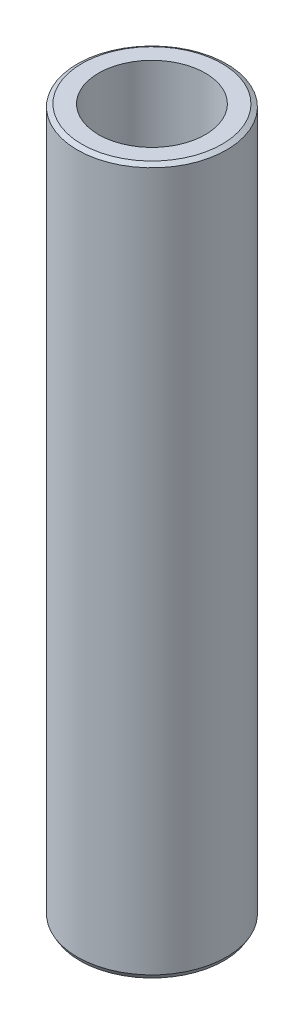
ISO-10303-21;
HEADER;
FILE_DESCRIPTION(('STEP AP214'),'2;1');
FILE_NAME('part.step','',(''),(''),'','','');
FILE_SCHEMA(('AUTOMOTIVE_DESIGN { 1 0 10303 214 1 1 1 1 }'));
ENDSEC;
DATA;
#1=APPLICATION_CONTEXT('core data for automotive mechanical design processes');
#2=APPLICATION_PROTOCOL_DEFINITION('international standard','automotive_design',2000,#1);
#3=PRODUCT_CONTEXT('',#1,'mechanical');
#4=PRODUCT('Part','Part','',(#3));
#5=PRODUCT_RELATED_PRODUCT_CATEGORY('part','',(#4));
#6=PRODUCT_DEFINITION_FORMATION('','',#4);
#7=PRODUCT_DEFINITION_CONTEXT('part definition',#1,'design');
#8=PRODUCT_DEFINITION('design','',#6,#7);
#9=PRODUCT_DEFINITION_SHAPE('','',#8);
#10=(LENGTH_UNIT() NAMED_UNIT(*) SI_UNIT(.MILLI.,.METRE.));
#11=(NAMED_UNIT(*) PLANE_ANGLE_UNIT() SI_UNIT($,.RADIAN.));
#12=(NAMED_UNIT(*) SI_UNIT($,.STERADIAN.) SOLID_ANGLE_UNIT());
#13=UNCERTAINTY_MEASURE_WITH_UNIT(LENGTH_MEASURE(1.E-05),#10,'distance_accuracy_value','');
#14=(GEOMETRIC_REPRESENTATION_CONTEXT(3) GLOBAL_UNCERTAINTY_ASSIGNED_CONTEXT((#13)) GLOBAL_UNIT_ASSIGNED_CONTEXT((#10,
#11,#12)) REPRESENTATION_CONTEXT('',''));
#15=CARTESIAN_POINT('',(0.,0.,0.));
#16=DIRECTION('',(0.,0.,1.));
#17=DIRECTION('',(1.,0.,0.));
#18=AXIS2_PLACEMENT_3D('',#15,#16,#17);
#19=CARTESIAN_POINT('',(0.,236.628721099628,0.));
#20=DIRECTION('',(0.,-1.,0.));
#21=DIRECTION('',(0.,0.,-1.));
#22=AXIS2_PLACEMENT_3D('',#19,#20,#21);
#23=CYLINDRICAL_SURFACE('',#22,25.);
#24=CARTESIAN_POINT('',(0.,235.744529769309,0.));
#25=DIRECTION('',(0.,1.,0.));
#26=DIRECTION('',(0.,0.,1.));
#27=AXIS2_PLACEMENT_3D('',#24,#25,#26);
#28=CIRCLE('',#27,25.);
#29=CARTESIAN_POINT('',(0.,235.744529769309,25.));
#30=VERTEX_POINT('',#29);
#31=EDGE_CURVE('E50',#30,#30,#28,.F.);
#32=ORIENTED_EDGE('',*,*,#31,.T.);
#33=EDGE_LOOP('',(#32));
#34=FACE_BOUND('',#33,.T.);
#35=CARTESIAN_POINT('',(0.,1.53146430772474,0.));
#36=DIRECTION('',(0.,1.,0.));
#37=DIRECTION('',(0.,0.,1.));
#38=AXIS2_PLACEMENT_3D('',#35,#36,#37);
#39=CIRCLE('',#38,25.);
#40=CARTESIAN_POINT('',(0.,1.53146430772474,25.));
#41=VERTEX_POINT('',#40);
#42=EDGE_CURVE('E51',#41,#41,#39,.T.);
#43=ORIENTED_EDGE('',*,*,#42,.T.);
#44=EDGE_LOOP('',(#43));
#45=FACE_BOUND('',#44,.T.);
#46=ADVANCED_FACE('F39',(#34,#45),#23,.T.);
#47=CARTESIAN_POINT('',(0.,236.628721099628,0.));
#48=DIRECTION('',(0.,1.,0.));
#49=DIRECTION('',(0.,0.,1.));
#50=AXIS2_PLACEMENT_3D('',#47,#48,#49);
#51=PLANE('',#50);
#52=CARTESIAN_POINT('',(0.,236.628721099628,0.));
#53=DIRECTION('',(0.,1.,0.));
#54=DIRECTION('',(0.,0.,1.));
#55=AXIS2_PLACEMENT_3D('',#52,#53,#54);
#56=CIRCLE('',#55,23.4685356922754);
#57=CARTESIAN_POINT('',(0.,236.628721099628,23.4685356922754));
#58=VERTEX_POINT('',#57);
#59=EDGE_CURVE('E54',#58,#58,#56,.T.);
#60=ORIENTED_EDGE('',*,*,#59,.T.);
#61=EDGE_LOOP('',(#60));
#62=FACE_BOUND('',#61,.T.);
#63=CARTESIAN_POINT('',(0.,236.628721099628,0.));
#64=DIRECTION('',(0.,1.,0.));
#65=DIRECTION('',(0.,0.,1.));
#66=AXIS2_PLACEMENT_3D('',#63,#64,#65);
#67=CIRCLE('',#66,17.8828120958732);
#68=CARTESIAN_POINT('',(0.,236.628721099628,17.8828120958732));
#69=VERTEX_POINT('',#68);
#70=EDGE_CURVE('E58',#69,#69,#67,.T.);
#71=ORIENTED_EDGE('',*,*,#70,.F.);
#72=EDGE_LOOP('',(#71));
#73=FACE_BOUND('',#72,.T.);
#74=ADVANCED_FACE('F69',(#62,#73),#51,.T.);
#75=CARTESIAN_POINT('',(0.,0.,0.));
#76=DIRECTION('',(0.,1.,0.));
#77=DIRECTION('',(0.,0.,1.));
#78=AXIS2_PLACEMENT_3D('',#75,#76,#77);
#79=PLANE('',#78);
#80=CARTESIAN_POINT('',(0.,0.,0.));
#81=DIRECTION('',(0.,1.,0.));
#82=DIRECTION('',(0.,0.,1.));
#83=AXIS2_PLACEMENT_3D('',#80,#81,#82);
#84=CIRCLE('',#83,24.1158086696808);
#85=CARTESIAN_POINT('',(0.,0.,24.1158086696808));
#86=VERTEX_POINT('',#85);
#87=EDGE_CURVE('E10',#86,#86,#84,.F.);
#88=ORIENTED_EDGE('',*,*,#87,.T.);
#89=EDGE_LOOP('',(#88));
#90=FACE_BOUND('',#89,.T.);
#91=CARTESIAN_POINT('',(0.,0.,0.));
#92=DIRECTION('',(0.,1.,0.));
#93=DIRECTION('',(0.,0.,1.));
#94=AXIS2_PLACEMENT_3D('',#91,#92,#93);
#95=CIRCLE('',#94,17.8828120958732);
#96=CARTESIAN_POINT('',(0.,0.,17.8828120958732));
#97=VERTEX_POINT('',#96);
#98=EDGE_CURVE('E63',#97,#97,#95,.T.);
#99=ORIENTED_EDGE('',*,*,#98,.T.);
#100=EDGE_LOOP('',(#99));
#101=FACE_BOUND('',#100,.T.);
#102=ADVANCED_FACE('F75',(#90,#101),#79,.F.);
#103=CARTESIAN_POINT('',(0.,236.628721099628,0.));
#104=DIRECTION('',(0.,-1.,0.));
#105=DIRECTION('',(0.,0.,-1.));
#106=AXIS2_PLACEMENT_3D('',#103,#104,#105);
#107=CYLINDRICAL_SURFACE('',#106,17.8828120958732);
#108=ORIENTED_EDGE('',*,*,#70,.T.);
#109=EDGE_LOOP('',(#108));
#110=FACE_BOUND('',#109,.T.);
#111=ORIENTED_EDGE('',*,*,#98,.F.);
#112=EDGE_LOOP('',(#111));
#113=FACE_BOUND('',#112,.T.);
#114=ADVANCED_FACE('F70',(#110,#113),#107,.F.);
#115=CARTESIAN_POINT('',(0.,236.628721099628,0.));
#116=DIRECTION('',(0.,-1.,0.));
#117=DIRECTION('',(0.,0.,-1.));
#118=AXIS2_PLACEMENT_3D('',#115,#116,#117);
#119=CONICAL_SURFACE('',#118,23.4685356922754,1.04719755119656);
#120=ORIENTED_EDGE('',*,*,#31,.F.);
#121=EDGE_LOOP('',(#120));
#122=FACE_BOUND('',#121,.T.);
#123=ORIENTED_EDGE('',*,*,#59,.F.);
#124=EDGE_LOOP('',(#123));
#125=FACE_BOUND('',#124,.T.);
#126=ADVANCED_FACE('F81',(#122,#125),#119,.T.);
#127=CARTESIAN_POINT('',(0.,1.53146430772474,0.));
#128=DIRECTION('',(0.,1.,0.));
#129=DIRECTION('',(0.,0.,1.));
#130=AXIS2_PLACEMENT_3D('',#127,#128,#129);
#131=CONICAL_SURFACE('',#130,25.,0.5235987755983);
#132=ORIENTED_EDGE('',*,*,#87,.F.);
#133=EDGE_LOOP('',(#132));
#134=FACE_BOUND('',#133,.T.);
#135=ORIENTED_EDGE('',*,*,#42,.F.);
#136=EDGE_LOOP('',(#135));
#137=FACE_BOUND('',#136,.T.);
#138=ADVANCED_FACE('F45',(#134,#137),#131,.T.);
#139=CLOSED_SHELL('',(#46,#74,#102,#114,#126,#138));
#140=MANIFOLD_SOLID_BREP('B2',#139);
#141=ADVANCED_BREP_SHAPE_REPRESENTATION('',(#18,#140),#14);
#142=SHAPE_DEFINITION_REPRESENTATION(#9,#141);
ENDSEC;
END-ISO-10303-21;
